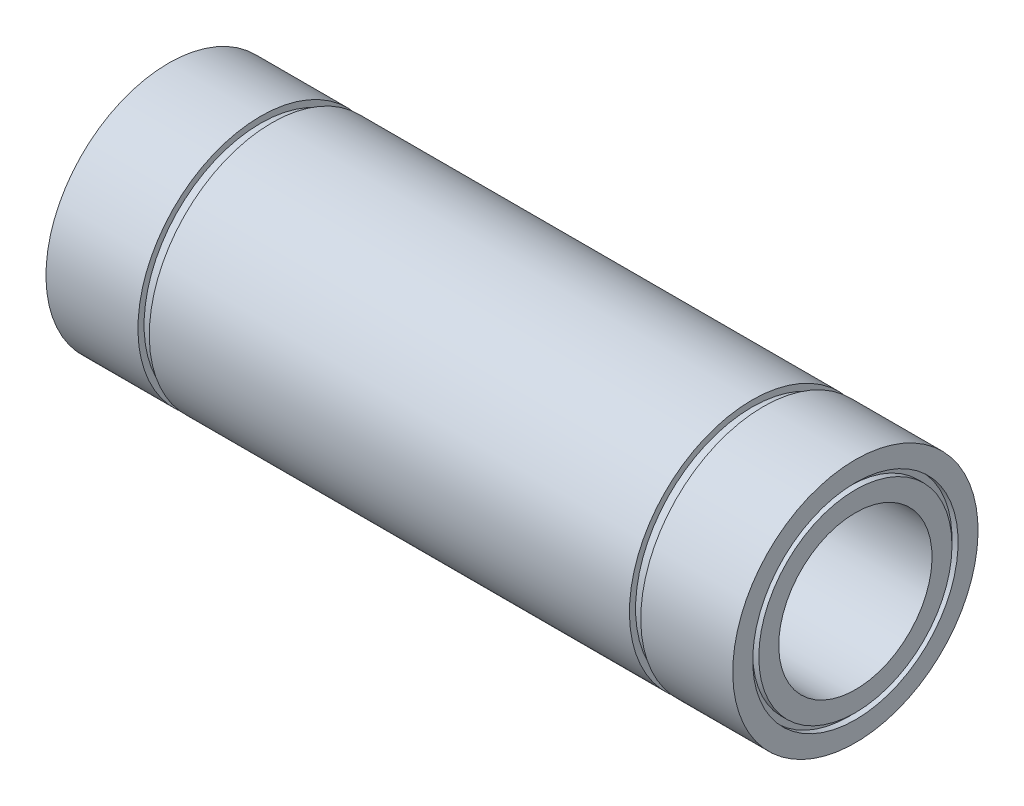
ISO-10303-21;
HEADER;
FILE_DESCRIPTION(('STEP AP214'),'2;1');
FILE_NAME('part.step','',(''),(''),'','','');
FILE_SCHEMA(('AUTOMOTIVE_DESIGN { 1 0 10303 214 1 1 1 1 }'));
ENDSEC;
DATA;
#1=APPLICATION_CONTEXT('core data for automotive mechanical design processes');
#2=APPLICATION_PROTOCOL_DEFINITION('international standard','automotive_design',2000,#1);
#3=PRODUCT_CONTEXT('',#1,'mechanical');
#4=PRODUCT('Part','Part','',(#3));
#5=PRODUCT_RELATED_PRODUCT_CATEGORY('part','',(#4));
#6=PRODUCT_DEFINITION_FORMATION('','',#4);
#7=PRODUCT_DEFINITION_CONTEXT('part definition',#1,'design');
#8=PRODUCT_DEFINITION('design','',#6,#7);
#9=PRODUCT_DEFINITION_SHAPE('','',#8);
#10=(LENGTH_UNIT() NAMED_UNIT(*) SI_UNIT(.MILLI.,.METRE.));
#11=(NAMED_UNIT(*) PLANE_ANGLE_UNIT() SI_UNIT($,.RADIAN.));
#12=(NAMED_UNIT(*) SI_UNIT($,.STERADIAN.) SOLID_ANGLE_UNIT());
#13=UNCERTAINTY_MEASURE_WITH_UNIT(LENGTH_MEASURE(1.E-05),#10,'distance_accuracy_value','');
#14=(GEOMETRIC_REPRESENTATION_CONTEXT(3) GLOBAL_UNCERTAINTY_ASSIGNED_CONTEXT((#13)) GLOBAL_UNIT_ASSIGNED_CONTEXT((#10,
#11,#12)) REPRESENTATION_CONTEXT('',''));
#15=CARTESIAN_POINT('',(0.,0.,0.));
#16=DIRECTION('',(0.,0.,1.));
#17=DIRECTION('',(1.,0.,0.));
#18=AXIS2_PLACEMENT_3D('',#15,#16,#17);
#19=CARTESIAN_POINT('',(-56.,16.75,0.));
#20=DIRECTION('',(-1.,0.,0.));
#21=DIRECTION('',(0.,-1.,0.));
#22=AXIS2_PLACEMENT_3D('',#19,#20,#21);
#23=PLANE('',#22);
#24=CARTESIAN_POINT('',(-56.,0.,0.));
#25=DIRECTION('',(1.,0.,0.));
#26=DIRECTION('',(0.,1.,0.));
#27=AXIS2_PLACEMENT_3D('',#24,#25,#26);
#28=CIRCLE('',#27,16.75);
#29=CARTESIAN_POINT('',(-56.,16.75,0.));
#30=VERTEX_POINT('',#29);
#31=EDGE_CURVE('E124',#30,#30,#28,.T.);
#32=ORIENTED_EDGE('',*,*,#31,.T.);
#33=EDGE_LOOP('',(#32));
#34=FACE_BOUND('',#33,.T.);
#35=CARTESIAN_POINT('',(-56.,0.,0.));
#36=DIRECTION('',(1.,0.,0.));
#37=DIRECTION('',(0.,1.,0.));
#38=AXIS2_PLACEMENT_3D('',#35,#36,#37);
#39=CIRCLE('',#38,20.);
#40=CARTESIAN_POINT('',(-56.,20.,0.));
#41=VERTEX_POINT('',#40);
#42=EDGE_CURVE('E10',#41,#41,#39,.T.);
#43=ORIENTED_EDGE('',*,*,#42,.F.);
#44=EDGE_LOOP('',(#43));
#45=FACE_BOUND('',#44,.T.);
#46=ADVANCED_FACE('F40',(#34,#45),#23,.T.);
#47=CARTESIAN_POINT('',(0.,0.,0.));
#48=DIRECTION('',(1.,0.,0.));
#49=DIRECTION('',(0.,1.,0.));
#50=AXIS2_PLACEMENT_3D('',#47,#48,#49);
#51=CYLINDRICAL_SURFACE('',#50,20.);
#52=ORIENTED_EDGE('',*,*,#42,.T.);
#53=EDGE_LOOP('',(#52));
#54=FACE_BOUND('',#53,.T.);
#55=CARTESIAN_POINT('',(-41.,0.,0.));
#56=DIRECTION('',(1.,0.,0.));
#57=DIRECTION('',(0.,1.,0.));
#58=AXIS2_PLACEMENT_3D('',#55,#56,#57);
#59=CIRCLE('',#58,20.);
#60=CARTESIAN_POINT('',(-41.,20.,0.));
#61=VERTEX_POINT('',#60);
#62=EDGE_CURVE('E47',#61,#61,#59,.T.);
#63=ORIENTED_EDGE('',*,*,#62,.F.);
#64=EDGE_LOOP('',(#63));
#65=FACE_BOUND('',#64,.T.);
#66=ADVANCED_FACE('F142',(#54,#65),#51,.T.);
#67=CARTESIAN_POINT('',(-41.,20.,0.));
#68=DIRECTION('',(1.,0.,0.));
#69=DIRECTION('',(0.,1.,0.));
#70=AXIS2_PLACEMENT_3D('',#67,#68,#69);
#71=PLANE('',#70);
#72=ORIENTED_EDGE('',*,*,#62,.T.);
#73=EDGE_LOOP('',(#72));
#74=FACE_BOUND('',#73,.T.);
#75=CARTESIAN_POINT('',(-41.,0.,0.));
#76=DIRECTION('',(1.,0.,0.));
#77=DIRECTION('',(0.,1.,0.));
#78=AXIS2_PLACEMENT_3D('',#75,#76,#77);
#79=CIRCLE('',#78,19.);
#80=CARTESIAN_POINT('',(-41.,19.,0.));
#81=VERTEX_POINT('',#80);
#82=EDGE_CURVE('E54',#81,#81,#79,.T.);
#83=ORIENTED_EDGE('',*,*,#82,.F.);
#84=EDGE_LOOP('',(#83));
#85=FACE_BOUND('',#84,.T.);
#86=ADVANCED_FACE('F146',(#74,#85),#71,.T.);
#87=CARTESIAN_POINT('',(0.,0.,0.));
#88=DIRECTION('',(1.,0.,0.));
#89=DIRECTION('',(0.,1.,0.));
#90=AXIS2_PLACEMENT_3D('',#87,#88,#89);
#91=CYLINDRICAL_SURFACE('',#90,19.);
#92=ORIENTED_EDGE('',*,*,#82,.T.);
#93=EDGE_LOOP('',(#92));
#94=FACE_BOUND('',#93,.T.);
#95=CARTESIAN_POINT('',(-39.15,0.,0.));
#96=DIRECTION('',(1.,0.,0.));
#97=DIRECTION('',(0.,1.,0.));
#98=AXIS2_PLACEMENT_3D('',#95,#96,#97);
#99=CIRCLE('',#98,19.);
#100=CARTESIAN_POINT('',(-39.15,19.,0.));
#101=VERTEX_POINT('',#100);
#102=EDGE_CURVE('E61',#101,#101,#99,.T.);
#103=ORIENTED_EDGE('',*,*,#102,.F.);
#104=EDGE_LOOP('',(#103));
#105=FACE_BOUND('',#104,.T.);
#106=ADVANCED_FACE('F150',(#94,#105),#91,.T.);
#107=CARTESIAN_POINT('',(-39.15,19.,0.));
#108=DIRECTION('',(-1.,0.,0.));
#109=DIRECTION('',(0.,-1.,0.));
#110=AXIS2_PLACEMENT_3D('',#107,#108,#109);
#111=PLANE('',#110);
#112=ORIENTED_EDGE('',*,*,#102,.T.);
#113=EDGE_LOOP('',(#112));
#114=FACE_BOUND('',#113,.T.);
#115=CARTESIAN_POINT('',(-39.15,0.,0.));
#116=DIRECTION('',(1.,0.,0.));
#117=DIRECTION('',(0.,1.,0.));
#118=AXIS2_PLACEMENT_3D('',#115,#116,#117);
#119=CIRCLE('',#118,20.);
#120=CARTESIAN_POINT('',(-39.15,20.,0.));
#121=VERTEX_POINT('',#120);
#122=EDGE_CURVE('E67',#121,#121,#119,.T.);
#123=ORIENTED_EDGE('',*,*,#122,.F.);
#124=EDGE_LOOP('',(#123));
#125=FACE_BOUND('',#124,.T.);
#126=ADVANCED_FACE('F156',(#114,#125),#111,.T.);
#127=CARTESIAN_POINT('',(0.,0.,0.));
#128=DIRECTION('',(1.,0.,0.));
#129=DIRECTION('',(0.,1.,0.));
#130=AXIS2_PLACEMENT_3D('',#127,#128,#129);
#131=CYLINDRICAL_SURFACE('',#130,20.);
#132=ORIENTED_EDGE('',*,*,#122,.T.);
#133=EDGE_LOOP('',(#132));
#134=FACE_BOUND('',#133,.T.);
#135=CARTESIAN_POINT('',(39.15,0.,0.));
#136=DIRECTION('',(1.,0.,0.));
#137=DIRECTION('',(0.,1.,0.));
#138=AXIS2_PLACEMENT_3D('',#135,#136,#137);
#139=CIRCLE('',#138,20.);
#140=CARTESIAN_POINT('',(39.15,20.,0.));
#141=VERTEX_POINT('',#140);
#142=EDGE_CURVE('E71',#141,#141,#139,.T.);
#143=ORIENTED_EDGE('',*,*,#142,.F.);
#144=EDGE_LOOP('',(#143));
#145=FACE_BOUND('',#144,.T.);
#146=ADVANCED_FACE('F160',(#134,#145),#131,.T.);
#147=CARTESIAN_POINT('',(39.15,20.,0.));
#148=DIRECTION('',(1.,0.,0.));
#149=DIRECTION('',(0.,1.,0.));
#150=AXIS2_PLACEMENT_3D('',#147,#148,#149);
#151=PLANE('',#150);
#152=ORIENTED_EDGE('',*,*,#142,.T.);
#153=EDGE_LOOP('',(#152));
#154=FACE_BOUND('',#153,.T.);
#155=CARTESIAN_POINT('',(39.15,0.,0.));
#156=DIRECTION('',(1.,0.,0.));
#157=DIRECTION('',(0.,1.,0.));
#158=AXIS2_PLACEMENT_3D('',#155,#156,#157);
#159=CIRCLE('',#158,19.);
#160=CARTESIAN_POINT('',(39.15,19.,0.));
#161=VERTEX_POINT('',#160);
#162=EDGE_CURVE('E75',#161,#161,#159,.T.);
#163=ORIENTED_EDGE('',*,*,#162,.F.);
#164=EDGE_LOOP('',(#163));
#165=FACE_BOUND('',#164,.T.);
#166=ADVANCED_FACE('F164',(#154,#165),#151,.T.);
#167=CARTESIAN_POINT('',(0.,0.,0.));
#168=DIRECTION('',(1.,0.,0.));
#169=DIRECTION('',(0.,1.,0.));
#170=AXIS2_PLACEMENT_3D('',#167,#168,#169);
#171=CYLINDRICAL_SURFACE('',#170,19.);
#172=ORIENTED_EDGE('',*,*,#162,.T.);
#173=EDGE_LOOP('',(#172));
#174=FACE_BOUND('',#173,.T.);
#175=CARTESIAN_POINT('',(41.,0.,0.));
#176=DIRECTION('',(1.,0.,0.));
#177=DIRECTION('',(0.,1.,0.));
#178=AXIS2_PLACEMENT_3D('',#175,#176,#177);
#179=CIRCLE('',#178,19.);
#180=CARTESIAN_POINT('',(41.,19.,0.));
#181=VERTEX_POINT('',#180);
#182=EDGE_CURVE('E79',#181,#181,#179,.T.);
#183=ORIENTED_EDGE('',*,*,#182,.F.);
#184=EDGE_LOOP('',(#183));
#185=FACE_BOUND('',#184,.T.);
#186=ADVANCED_FACE('F168',(#174,#185),#171,.T.);
#187=CARTESIAN_POINT('',(41.,19.,0.));
#188=DIRECTION('',(-1.,0.,0.));
#189=DIRECTION('',(0.,-1.,0.));
#190=AXIS2_PLACEMENT_3D('',#187,#188,#189);
#191=PLANE('',#190);
#192=ORIENTED_EDGE('',*,*,#182,.T.);
#193=EDGE_LOOP('',(#192));
#194=FACE_BOUND('',#193,.T.);
#195=CARTESIAN_POINT('',(41.,0.,0.));
#196=DIRECTION('',(1.,0.,0.));
#197=DIRECTION('',(0.,1.,0.));
#198=AXIS2_PLACEMENT_3D('',#195,#196,#197);
#199=CIRCLE('',#198,20.);
#200=CARTESIAN_POINT('',(41.,20.,0.));
#201=VERTEX_POINT('',#200);
#202=EDGE_CURVE('E83',#201,#201,#199,.T.);
#203=ORIENTED_EDGE('',*,*,#202,.F.);
#204=EDGE_LOOP('',(#203));
#205=FACE_BOUND('',#204,.T.);
#206=ADVANCED_FACE('F172',(#194,#205),#191,.T.);
#207=CARTESIAN_POINT('',(0.,0.,0.));
#208=DIRECTION('',(1.,0.,0.));
#209=DIRECTION('',(0.,1.,0.));
#210=AXIS2_PLACEMENT_3D('',#207,#208,#209);
#211=CYLINDRICAL_SURFACE('',#210,20.);
#212=ORIENTED_EDGE('',*,*,#202,.T.);
#213=EDGE_LOOP('',(#212));
#214=FACE_BOUND('',#213,.T.);
#215=CARTESIAN_POINT('',(56.,0.,0.));
#216=DIRECTION('',(1.,0.,0.));
#217=DIRECTION('',(0.,1.,0.));
#218=AXIS2_PLACEMENT_3D('',#215,#216,#217);
#219=CIRCLE('',#218,20.);
#220=CARTESIAN_POINT('',(56.,20.,0.));
#221=VERTEX_POINT('',#220);
#222=EDGE_CURVE('E87',#221,#221,#219,.T.);
#223=ORIENTED_EDGE('',*,*,#222,.F.);
#224=EDGE_LOOP('',(#223));
#225=FACE_BOUND('',#224,.T.);
#226=ADVANCED_FACE('F176',(#214,#225),#211,.T.);
#227=CARTESIAN_POINT('',(56.,20.,0.));
#228=DIRECTION('',(1.,0.,0.));
#229=DIRECTION('',(0.,1.,0.));
#230=AXIS2_PLACEMENT_3D('',#227,#228,#229);
#231=PLANE('',#230);
#232=ORIENTED_EDGE('',*,*,#222,.T.);
#233=EDGE_LOOP('',(#232));
#234=FACE_BOUND('',#233,.T.);
#235=CARTESIAN_POINT('',(56.,0.,0.));
#236=DIRECTION('',(1.,0.,0.));
#237=DIRECTION('',(0.,1.,0.));
#238=AXIS2_PLACEMENT_3D('',#235,#236,#237);
#239=CIRCLE('',#238,16.75);
#240=CARTESIAN_POINT('',(56.,16.75,0.));
#241=VERTEX_POINT('',#240);
#242=EDGE_CURVE('E90',#241,#241,#239,.T.);
#243=ORIENTED_EDGE('',*,*,#242,.F.);
#244=EDGE_LOOP('',(#243));
#245=FACE_BOUND('',#244,.T.);
#246=ADVANCED_FACE('F180',(#234,#245),#231,.T.);
#247=CARTESIAN_POINT('',(0.,0.,0.));
#248=DIRECTION('',(1.,0.,0.));
#249=DIRECTION('',(0.,1.,0.));
#250=AXIS2_PLACEMENT_3D('',#247,#248,#249);
#251=CYLINDRICAL_SURFACE('',#250,16.75);
#252=ORIENTED_EDGE('',*,*,#242,.T.);
#253=EDGE_LOOP('',(#252));
#254=FACE_BOUND('',#253,.T.);
#255=CARTESIAN_POINT('',(55.,0.,0.));
#256=DIRECTION('',(1.,0.,0.));
#257=DIRECTION('',(0.,1.,0.));
#258=AXIS2_PLACEMENT_3D('',#255,#256,#257);
#259=CIRCLE('',#258,16.75);
#260=CARTESIAN_POINT('',(55.,16.75,0.));
#261=VERTEX_POINT('',#260);
#262=EDGE_CURVE('E94',#261,#261,#259,.T.);
#263=ORIENTED_EDGE('',*,*,#262,.F.);
#264=EDGE_LOOP('',(#263));
#265=FACE_BOUND('',#264,.T.);
#266=ADVANCED_FACE('F184',(#254,#265),#251,.F.);
#267=CARTESIAN_POINT('',(55.,16.75,0.));
#268=DIRECTION('',(1.,0.,0.));
#269=DIRECTION('',(0.,1.,0.));
#270=AXIS2_PLACEMENT_3D('',#267,#268,#269);
#271=PLANE('',#270);
#272=ORIENTED_EDGE('',*,*,#262,.T.);
#273=EDGE_LOOP('',(#272));
#274=FACE_BOUND('',#273,.T.);
#275=CARTESIAN_POINT('',(55.,0.,0.));
#276=DIRECTION('',(1.,0.,0.));
#277=DIRECTION('',(0.,1.,0.));
#278=AXIS2_PLACEMENT_3D('',#275,#276,#277);
#279=CIRCLE('',#278,15.75);
#280=CARTESIAN_POINT('',(55.,15.75,0.));
#281=VERTEX_POINT('',#280);
#282=EDGE_CURVE('E98',#281,#281,#279,.T.);
#283=ORIENTED_EDGE('',*,*,#282,.F.);
#284=EDGE_LOOP('',(#283));
#285=FACE_BOUND('',#284,.T.);
#286=ADVANCED_FACE('F188',(#274,#285),#271,.T.);
#287=CARTESIAN_POINT('',(0.,0.,0.));
#288=DIRECTION('',(1.,0.,0.));
#289=DIRECTION('',(0.,1.,0.));
#290=AXIS2_PLACEMENT_3D('',#287,#288,#289);
#291=CYLINDRICAL_SURFACE('',#290,15.75);
#292=ORIENTED_EDGE('',*,*,#282,.T.);
#293=EDGE_LOOP('',(#292));
#294=FACE_BOUND('',#293,.T.);
#295=CARTESIAN_POINT('',(56.,0.,0.));
#296=DIRECTION('',(1.,0.,0.));
#297=DIRECTION('',(0.,1.,0.));
#298=AXIS2_PLACEMENT_3D('',#295,#296,#297);
#299=CIRCLE('',#298,15.75);
#300=CARTESIAN_POINT('',(56.,15.75,0.));
#301=VERTEX_POINT('',#300);
#302=EDGE_CURVE('E101',#301,#301,#299,.T.);
#303=ORIENTED_EDGE('',*,*,#302,.F.);
#304=EDGE_LOOP('',(#303));
#305=FACE_BOUND('',#304,.T.);
#306=ADVANCED_FACE('F192',(#294,#305),#291,.T.);
#307=CARTESIAN_POINT('',(56.,15.75,0.));
#308=DIRECTION('',(1.,0.,0.));
#309=DIRECTION('',(0.,1.,0.));
#310=AXIS2_PLACEMENT_3D('',#307,#308,#309);
#311=PLANE('',#310);
#312=ORIENTED_EDGE('',*,*,#302,.T.);
#313=EDGE_LOOP('',(#312));
#314=FACE_BOUND('',#313,.T.);
#315=CARTESIAN_POINT('',(56.,0.,0.));
#316=DIRECTION('',(1.,0.,0.));
#317=DIRECTION('',(0.,1.,0.));
#318=AXIS2_PLACEMENT_3D('',#315,#316,#317);
#319=CIRCLE('',#318,12.5);
#320=CARTESIAN_POINT('',(56.,12.5,0.));
#321=VERTEX_POINT('',#320);
#322=EDGE_CURVE('E105',#321,#321,#319,.T.);
#323=ORIENTED_EDGE('',*,*,#322,.F.);
#324=EDGE_LOOP('',(#323));
#325=FACE_BOUND('',#324,.T.);
#326=ADVANCED_FACE('F196',(#314,#325),#311,.T.);
#327=CARTESIAN_POINT('',(0.,0.,0.));
#328=DIRECTION('',(1.,0.,0.));
#329=DIRECTION('',(0.,1.,0.));
#330=AXIS2_PLACEMENT_3D('',#327,#328,#329);
#331=CYLINDRICAL_SURFACE('',#330,12.5);
#332=ORIENTED_EDGE('',*,*,#322,.T.);
#333=EDGE_LOOP('',(#332));
#334=FACE_BOUND('',#333,.T.);
#335=CARTESIAN_POINT('',(-56.,0.,0.));
#336=DIRECTION('',(1.,0.,0.));
#337=DIRECTION('',(0.,1.,0.));
#338=AXIS2_PLACEMENT_3D('',#335,#336,#337);
#339=CIRCLE('',#338,12.5);
#340=CARTESIAN_POINT('',(-56.,12.5,0.));
#341=VERTEX_POINT('',#340);
#342=EDGE_CURVE('E109',#341,#341,#339,.T.);
#343=ORIENTED_EDGE('',*,*,#342,.F.);
#344=EDGE_LOOP('',(#343));
#345=FACE_BOUND('',#344,.T.);
#346=ADVANCED_FACE('F200',(#334,#345),#331,.F.);
#347=CARTESIAN_POINT('',(-56.,12.5,0.));
#348=DIRECTION('',(-1.,0.,0.));
#349=DIRECTION('',(0.,-1.,0.));
#350=AXIS2_PLACEMENT_3D('',#347,#348,#349);
#351=PLANE('',#350);
#352=ORIENTED_EDGE('',*,*,#342,.T.);
#353=EDGE_LOOP('',(#352));
#354=FACE_BOUND('',#353,.T.);
#355=CARTESIAN_POINT('',(-56.,0.,0.));
#356=DIRECTION('',(1.,0.,0.));
#357=DIRECTION('',(0.,1.,0.));
#358=AXIS2_PLACEMENT_3D('',#355,#356,#357);
#359=CIRCLE('',#358,15.75);
#360=CARTESIAN_POINT('',(-56.,15.75,0.));
#361=VERTEX_POINT('',#360);
#362=EDGE_CURVE('E113',#361,#361,#359,.T.);
#363=ORIENTED_EDGE('',*,*,#362,.F.);
#364=EDGE_LOOP('',(#363));
#365=FACE_BOUND('',#364,.T.);
#366=ADVANCED_FACE('F204',(#354,#365),#351,.T.);
#367=CARTESIAN_POINT('',(0.,0.,0.));
#368=DIRECTION('',(1.,0.,0.));
#369=DIRECTION('',(0.,1.,0.));
#370=AXIS2_PLACEMENT_3D('',#367,#368,#369);
#371=CYLINDRICAL_SURFACE('',#370,15.75);
#372=ORIENTED_EDGE('',*,*,#362,.T.);
#373=EDGE_LOOP('',(#372));
#374=FACE_BOUND('',#373,.T.);
#375=CARTESIAN_POINT('',(-55.,0.,0.));
#376=DIRECTION('',(1.,0.,0.));
#377=DIRECTION('',(0.,1.,0.));
#378=AXIS2_PLACEMENT_3D('',#375,#376,#377);
#379=CIRCLE('',#378,15.75);
#380=CARTESIAN_POINT('',(-55.,15.75,0.));
#381=VERTEX_POINT('',#380);
#382=EDGE_CURVE('E116',#381,#381,#379,.T.);
#383=ORIENTED_EDGE('',*,*,#382,.F.);
#384=EDGE_LOOP('',(#383));
#385=FACE_BOUND('',#384,.T.);
#386=ADVANCED_FACE('F138',(#374,#385),#371,.T.);
#387=CARTESIAN_POINT('',(-55.,16.75,0.));
#388=DIRECTION('',(-1.,0.,0.));
#389=DIRECTION('',(0.,-1.,0.));
#390=AXIS2_PLACEMENT_3D('',#387,#388,#389);
#391=PLANE('',#390);
#392=ORIENTED_EDGE('',*,*,#382,.T.);
#393=EDGE_LOOP('',(#392));
#394=FACE_BOUND('',#393,.T.);
#395=CARTESIAN_POINT('',(-55.,0.,0.));
#396=DIRECTION('',(1.,0.,0.));
#397=DIRECTION('',(0.,1.,0.));
#398=AXIS2_PLACEMENT_3D('',#395,#396,#397);
#399=CIRCLE('',#398,16.75);
#400=CARTESIAN_POINT('',(-55.,16.75,0.));
#401=VERTEX_POINT('',#400);
#402=EDGE_CURVE('E120',#401,#401,#399,.T.);
#403=ORIENTED_EDGE('',*,*,#402,.F.);
#404=EDGE_LOOP('',(#403));
#405=FACE_BOUND('',#404,.T.);
#406=ADVANCED_FACE('F132',(#394,#405),#391,.T.);
#407=CARTESIAN_POINT('',(0.,0.,0.));
#408=DIRECTION('',(1.,0.,0.));
#409=DIRECTION('',(0.,1.,0.));
#410=AXIS2_PLACEMENT_3D('',#407,#408,#409);
#411=CYLINDRICAL_SURFACE('',#410,16.75);
#412=ORIENTED_EDGE('',*,*,#402,.T.);
#413=EDGE_LOOP('',(#412));
#414=FACE_BOUND('',#413,.T.);
#415=ORIENTED_EDGE('',*,*,#31,.F.);
#416=EDGE_LOOP('',(#415));
#417=FACE_BOUND('',#416,.T.);
#418=ADVANCED_FACE('F130',(#414,#417),#411,.F.);
#419=CLOSED_SHELL('',(#46,#66,#86,#106,#126,#146,#166,#186,#206,#226,#246,#266,#286,#306,#326,
#346,#366,#386,#406,#418));
#420=MANIFOLD_SOLID_BREP('B2',#419);
#421=ADVANCED_BREP_SHAPE_REPRESENTATION('',(#18,#420),#14);
#422=SHAPE_DEFINITION_REPRESENTATION(#9,#421);
ENDSEC;
END-ISO-10303-21;
